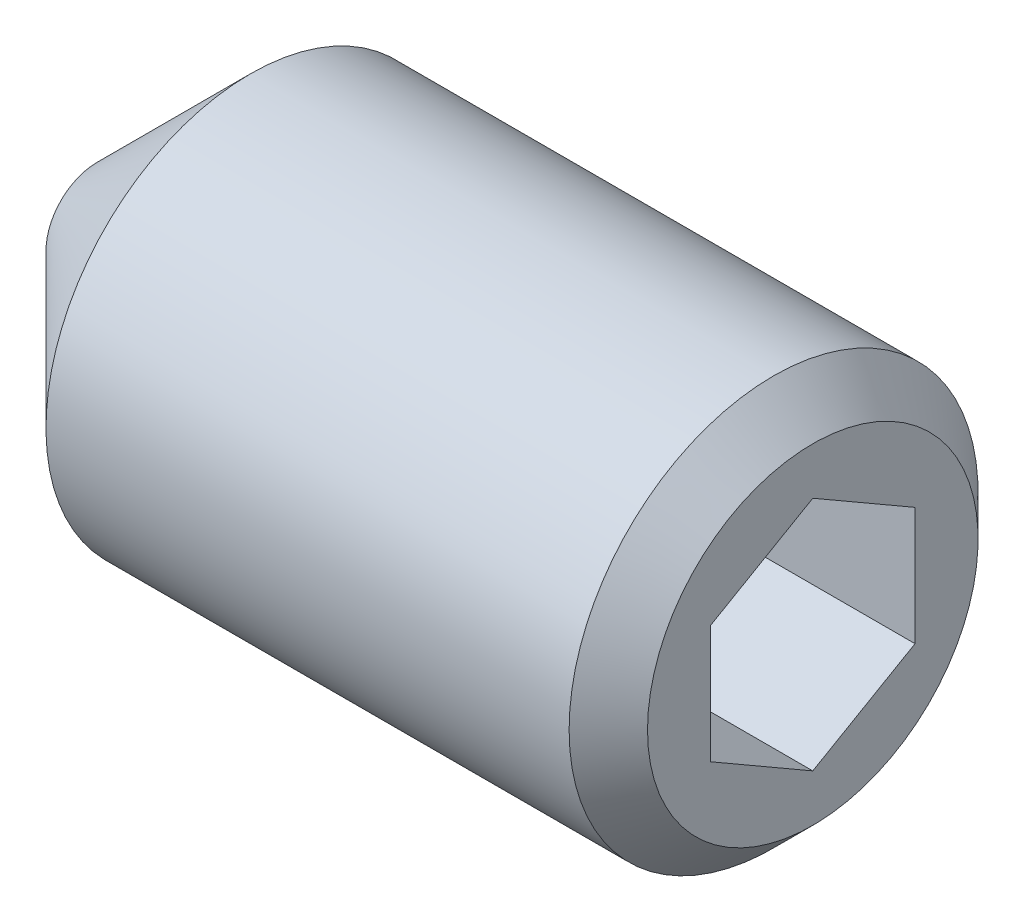
ISO-10303-21;
HEADER;
FILE_DESCRIPTION(('STEP AP214'),'2;1');
FILE_NAME('part.step','',(''),(''),'','','');
FILE_SCHEMA(('AUTOMOTIVE_DESIGN { 1 0 10303 214 1 1 1 1 }'));
ENDSEC;
DATA;
#1=APPLICATION_CONTEXT('core data for automotive mechanical design processes');
#2=APPLICATION_PROTOCOL_DEFINITION('international standard','automotive_design',2000,#1);
#3=PRODUCT_CONTEXT('',#1,'mechanical');
#4=PRODUCT('Part','Part','',(#3));
#5=PRODUCT_RELATED_PRODUCT_CATEGORY('part','',(#4));
#6=PRODUCT_DEFINITION_FORMATION('','',#4);
#7=PRODUCT_DEFINITION_CONTEXT('part definition',#1,'design');
#8=PRODUCT_DEFINITION('design','',#6,#7);
#9=PRODUCT_DEFINITION_SHAPE('','',#8);
#10=(LENGTH_UNIT() NAMED_UNIT(*) SI_UNIT(.MILLI.,.METRE.));
#11=(NAMED_UNIT(*) PLANE_ANGLE_UNIT() SI_UNIT($,.RADIAN.));
#12=(NAMED_UNIT(*) SI_UNIT($,.STERADIAN.) SOLID_ANGLE_UNIT());
#13=UNCERTAINTY_MEASURE_WITH_UNIT(LENGTH_MEASURE(1.E-05),#10,'distance_accuracy_value','');
#14=(GEOMETRIC_REPRESENTATION_CONTEXT(3) GLOBAL_UNCERTAINTY_ASSIGNED_CONTEXT((#13)) GLOBAL_UNIT_ASSIGNED_CONTEXT((#10,
#11,#12)) REPRESENTATION_CONTEXT('',''));
#15=CARTESIAN_POINT('',(0.,0.,0.));
#16=DIRECTION('',(0.,0.,1.));
#17=DIRECTION('',(1.,0.,0.));
#18=AXIS2_PLACEMENT_3D('',#15,#16,#17);
#19=CARTESIAN_POINT('',(9.00800000118807,0.,0.));
#20=DIRECTION('',(1.,0.,0.));
#21=DIRECTION('',(0.,0.,-1.));
#22=AXIS2_PLACEMENT_3D('',#19,#20,#21);
#23=CONICAL_SURFACE('',#22,2.32325748214635,1.04719754985041);
#24=CARTESIAN_POINT('',(7.66666666464744,-1.70530256582424E-10,0.));
#25=VERTEX_POINT('',#24);
#26=VERTEX_LOOP('',#25);
#27=FACE_BOUND('',#26,.T.);
#28=CARTESIAN_POINT('',(9.00000000144632,-1.1547005388733,1.99999999980313));
#29=CARTESIAN_POINT('',(8.97069554661901,-1.20544263425079,1.9121121121046));
#30=CARTESIAN_POINT('',(8.94404467857055,-1.25662273477581,1.82346557748557));
#31=CARTESIAN_POINT('',(8.89752638878152,-1.35986908512504,1.64463765285765));
#32=CARTESIAN_POINT('',(8.87767542165244,-1.41193716884017,1.55445308645704));
#33=CARTESIAN_POINT('',(8.84677596017859,-1.51542808258427,1.37520156576378));
#34=CARTESIAN_POINT('',(8.83552178881234,-1.56683499367059,1.28616218389005));
#35=CARTESIAN_POINT('',(8.82208916933915,-1.66989057615404,1.10766467901636));
#36=CARTESIAN_POINT('',(8.81989959519307,-1.72153887322915,1.01820720436114));
#37=CARTESIAN_POINT('',(8.82446629142046,-1.81803817556745,0.851065509818308));
#38=CARTESIAN_POINT('',(8.83010128650724,-1.86290366133762,0.773356208957408));
#39=CARTESIAN_POINT('',(8.8479573020661,-1.95234234887182,0.61844385798539));
#40=CARTESIAN_POINT('',(8.86018441614834,-1.99691524152218,0.541241343274824));
#41=CARTESIAN_POINT('',(8.89074983478849,-2.0865381811873,0.386009858251314));
#42=CARTESIAN_POINT('',(8.90921764370782,-2.13157689093158,0.308000524666825));
#43=CARTESIAN_POINT('',(8.95113176241171,-2.22098275234762,0.153145030199717));
#44=CARTESIAN_POINT('',(8.97456823036794,-2.26535104852824,0.0762968869695697));
#45=CARTESIAN_POINT('',(9.00000000166053,-2.3094010765472,3.65972336919312E-10));
#46=B_SPLINE_CURVE_WITH_KNOTS('',3,(#28,#29,#30,#31,#32,#33,#34,#35,#36,#37,#38,#39,#40,#41,#42,
#43,#44,#45),.UNSPECIFIED.,.F.,.F.,(4,2,2,2,2,2,2,2,4),(0.,0.317016011630611,0.634793817186324,
0.944707606358906,1.25424088914511,1.52370778262934,1.79342419354458,2.06912162200915,
2.34427797280119),.UNSPECIFIED.);
#47=CARTESIAN_POINT('',(9.00000000164541,-1.15470053826051,1.99999999979432));
#48=VERTEX_POINT('',#47);
#49=CARTESIAN_POINT('',(9.00000000171396,-2.30940107663975,2.05669987642726E-10));
#50=VERTEX_POINT('',#49);
#51=EDGE_CURVE('E22',#48,#50,#46,.T.);
#52=ORIENTED_EDGE('',*,*,#51,.T.);
#53=CARTESIAN_POINT('',(9.00000000144633,-2.30940107683503,-5.26293975634497E-10));
#54=CARTESIAN_POINT('',(8.97069554661902,-2.25865898109189,-0.0878878880137153));
#55=CARTESIAN_POINT('',(8.94404467857055,-2.20747888041687,-0.176534422546136));
#56=CARTESIAN_POINT('',(8.89752638878152,-2.10423252995766,-0.355362347110558));
#57=CARTESIAN_POINT('',(8.87767542165244,-2.05216444628301,-0.445546913534539));
#58=CARTESIAN_POINT('',(8.84677596017859,-1.9486735325677,-0.624798434244422));
#59=CARTESIAN_POINT('',(8.83552178881234,-1.89726662147095,-0.713837816112135));
#60=CARTESIAN_POINT('',(8.82208916933915,-1.79421103897993,-0.892335320981448));
#61=CARTESIAN_POINT('',(8.81989959519307,-1.74256274190766,-0.981792795638309));
#62=CARTESIAN_POINT('',(8.82446629142046,-1.64606343957113,-1.14893449018216));
#63=CARTESIAN_POINT('',(8.83010128650723,-1.60119795380035,-1.22664379104272));
#64=CARTESIAN_POINT('',(8.8479573020661,-1.51175926626571,-1.38155614201448));
#65=CARTESIAN_POINT('',(8.86018441614834,-1.4671863736155,-1.45875865672513));
#66=CARTESIAN_POINT('',(8.89074983478849,-1.37756343395052,-1.61399014174872));
#67=CARTESIAN_POINT('',(8.90921764370782,-1.3325247242062,-1.69199947533319));
#68=CARTESIAN_POINT('',(8.95113176241171,-1.2431188627901,-1.84685496980026));
#69=CARTESIAN_POINT('',(8.97456823036794,-1.19875056660944,-1.92370311303039));
#70=CARTESIAN_POINT('',(9.00000000166053,-1.15470053859054,-1.99999999963402));
#71=B_SPLINE_CURVE_WITH_KNOTS('',3,(#53,#54,#55,#56,#57,#58,#59,#60,#61,#62,#63,#64,#65,#66,#67,
#68,#69,#70),.UNSPECIFIED.,.F.,.F.,(4,2,2,2,2,2,2,2,4),(0.,0.317016011630612,0.634793817186325,
0.944707606358909,1.25424088914511,1.52370778262934,1.79342419354459,2.06912162200916,
2.34427797280119),.UNSPECIFIED.);
#72=CARTESIAN_POINT('',(9.00000000171396,-1.15470053849799,-1.99999999979432));
#73=VERTEX_POINT('',#72);
#74=EDGE_CURVE('E112',#50,#73,#71,.T.);
#75=ORIENTED_EDGE('',*,*,#74,.T.);
#76=CARTESIAN_POINT('',(9.00000000144632,-1.15470053796173,-2.00000000032942));
#77=CARTESIAN_POINT('',(8.97069554661902,-1.05321634684111,-2.00000000011831));
#78=CARTESIAN_POINT('',(8.94404467857055,-0.950856145641067,-2.00000000003171));
#79=CARTESIAN_POINT('',(8.89752638878152,-0.744363444832626,-1.99999999996821));
#80=CARTESIAN_POINT('',(8.87767542165244,-0.640227277442849,-1.99999999999158));
#81=CARTESIAN_POINT('',(8.84677596017859,-0.433245449983443,-2.0000000000082));
#82=CARTESIAN_POINT('',(8.83552178881234,-0.330431627800365,-2.00000000000219));
#83=CARTESIAN_POINT('',(8.82208916933915,-0.124320462825891,-1.99999999999781));
#84=CARTESIAN_POINT('',(8.81989959519307,-0.0210238686785109,-1.99999999999945));
#85=CARTESIAN_POINT('',(8.82446629142046,0.171974735996308,-2.00000000000047));
#86=CARTESIAN_POINT('',(8.83010128650723,0.261705707537264,-2.00000000000013));
#87=CARTESIAN_POINT('',(8.8479573020661,0.440583082606101,-1.99999999999987));
#88=CARTESIAN_POINT('',(8.86018441614834,0.529728867906677,-1.99999999999996));
#89=CARTESIAN_POINT('',(8.89074983478849,0.708974747236779,-2.00000000000004));
#90=CARTESIAN_POINT('',(8.90921764370782,0.799052166725384,-2.00000000000002));
#91=CARTESIAN_POINT('',(8.95113176241171,0.977863889557518,-1.99999999999998));
#92=CARTESIAN_POINT('',(8.97456823036794,1.0666004819188,-1.99999999999996));
#93=CARTESIAN_POINT('',(9.00000000166053,1.15470053795666,-2.));
#94=B_SPLINE_CURVE_WITH_KNOTS('',3,(#76,#77,#78,#79,#80,#81,#82,#83,#84,#85,#86,#87,#88,#89,#90,
#91,#92,#93),.UNSPECIFIED.,.F.,.F.,(4,2,2,2,2,2,2,2,4),(0.,0.317016011630611,0.634793817186325,
0.944707606358907,1.25424088914511,1.52370778262934,1.79342419354459,2.06912162200916,
2.34427797280119),.UNSPECIFIED.);
#95=CARTESIAN_POINT('',(9.00000000171396,1.15470053814176,-1.99999999999999));
#96=VERTEX_POINT('',#95);
#97=EDGE_CURVE('E108',#73,#96,#94,.T.);
#98=ORIENTED_EDGE('',*,*,#97,.T.);
#99=CARTESIAN_POINT('',(9.00000000144632,1.1547005388733,-1.99999999980313));
#100=CARTESIAN_POINT('',(8.97069554661901,1.20544263425078,-1.91211211210459));
#101=CARTESIAN_POINT('',(8.94404467857055,1.2566227347758,-1.82346557748557));
#102=CARTESIAN_POINT('',(8.89752638878151,1.35986908512503,-1.64463765285765));
#103=CARTESIAN_POINT('',(8.87767542165244,1.41193716884016,-1.55445308645704));
#104=CARTESIAN_POINT('',(8.84677596017859,1.51542808258426,-1.37520156576378));
#105=CARTESIAN_POINT('',(8.83552178881233,1.56683499367058,-1.28616218389005));
#106=CARTESIAN_POINT('',(8.82208916933915,1.66989057615403,-1.10766467901636));
#107=CARTESIAN_POINT('',(8.81989959519306,1.72153887322914,-1.01820720436114));
#108=CARTESIAN_POINT('',(8.82446629142046,1.81803817556744,-0.85106550981831));
#109=CARTESIAN_POINT('',(8.83010128650723,1.86290366133761,-0.773356208957409));
#110=CARTESIAN_POINT('',(8.8479573020661,1.95234234887181,-0.61844385798539));
#111=CARTESIAN_POINT('',(8.86018441614834,1.99691524152217,-0.541241343274824));
#112=CARTESIAN_POINT('',(8.89074983478849,2.08653818118729,-0.386009858251314));
#113=CARTESIAN_POINT('',(8.90921764370782,2.13157689093158,-0.308000524666825));
#114=CARTESIAN_POINT('',(8.95113176241171,2.22098275234761,-0.153145030199716));
#115=CARTESIAN_POINT('',(8.97456823036794,2.26535104852824,-0.0762968869695689));
#116=CARTESIAN_POINT('',(9.00000000166053,2.3094010765472,-3.65971082070167E-10));
#117=B_SPLINE_CURVE_WITH_KNOTS('',3,(#99,#100,#101,#102,#103,#104,#105,#106,#107,#108,#109,#110,
#111,#112,#113,#114,#115,#116),.UNSPECIFIED.,.F.,.F.,(4,2,2,2,2,2,2,2,4),(0.,0.31701601163061,
0.634793817186322,0.944707606358904,1.2542408891451,1.52370778262934,1.79342419354458,
2.06912162200915,2.34427797280119),.UNSPECIFIED.);
#118=CARTESIAN_POINT('',(9.00000000171396,2.30940107663975,-2.05673827678857E-10));
#119=VERTEX_POINT('',#118);
#120=EDGE_CURVE('E104',#96,#119,#117,.T.);
#121=ORIENTED_EDGE('',*,*,#120,.T.);
#122=CARTESIAN_POINT('',(9.00000000144632,2.30940107683503,5.26291496868138E-10));
#123=CARTESIAN_POINT('',(8.97069554661901,2.25865898109189,0.0878878880137124));
#124=CARTESIAN_POINT('',(8.94404467857055,2.20747888041687,0.176534422546133));
#125=CARTESIAN_POINT('',(8.89752638878151,2.10423252995766,0.355362347110554));
#126=CARTESIAN_POINT('',(8.87767542165244,2.05216444628301,0.445546913534534));
#127=CARTESIAN_POINT('',(8.84677596017859,1.9486735325677,0.624798434244417));
#128=CARTESIAN_POINT('',(8.83552178881233,1.89726662147095,0.713837816112129));
#129=CARTESIAN_POINT('',(8.82208916933915,1.79421103897992,0.892335320981442));
#130=CARTESIAN_POINT('',(8.81989959519306,1.74256274190765,0.981792795638302));
#131=CARTESIAN_POINT('',(8.82446629142046,1.64606343957113,1.14893449018216));
#132=CARTESIAN_POINT('',(8.83010128650723,1.60119795380035,1.22664379104271));
#133=CARTESIAN_POINT('',(8.8479573020661,1.51175926626571,1.38155614201447));
#134=CARTESIAN_POINT('',(8.86018441614834,1.4671863736155,1.45875865672513));
#135=CARTESIAN_POINT('',(8.89074983478849,1.37756343395051,1.61399014174872));
#136=CARTESIAN_POINT('',(8.90921764370782,1.33252472420619,1.69199947533319));
#137=CARTESIAN_POINT('',(8.95113176241171,1.24311886279009,1.84685496980026));
#138=CARTESIAN_POINT('',(8.97456823036794,1.19875056660943,1.92370311303039));
#139=CARTESIAN_POINT('',(9.00000000166053,1.15470053859053,1.99999999963403));
#140=B_SPLINE_CURVE_WITH_KNOTS('',3,(#122,#123,#124,#125,#126,#127,#128,#129,#130,#131,#132,
#133,#134,#135,#136,#137,#138,#139),.UNSPECIFIED.,.F.,.F.,(4,2,2,2,2,2,2,2,4),(0.,
0.317016011630611,0.634793817186323,0.944707606358905,1.25424088914511,1.52370778262934,
1.79342419354459,2.06912162200916,2.3442779728012),.UNSPECIFIED.);
#141=CARTESIAN_POINT('',(9.00000000171396,1.15470053849799,1.99999999979432));
#142=VERTEX_POINT('',#141);
#143=EDGE_CURVE('E87',#119,#142,#140,.T.);
#144=ORIENTED_EDGE('',*,*,#143,.T.);
#145=CARTESIAN_POINT('',(9.00000000144632,1.15470053796172,2.00000000032942));
#146=CARTESIAN_POINT('',(8.97069554661901,1.0532163468411,2.00000000011831));
#147=CARTESIAN_POINT('',(8.94404467857055,0.950856145641057,2.00000000003171));
#148=CARTESIAN_POINT('',(8.89752638878151,0.744363444832616,1.99999999996821));
#149=CARTESIAN_POINT('',(8.87767542165244,0.64022727744284,1.99999999999158));
#150=CARTESIAN_POINT('',(8.84677596017859,0.433245449983435,2.0000000000082));
#151=CARTESIAN_POINT('',(8.83552178881233,0.330431627800356,2.00000000000218));
#152=CARTESIAN_POINT('',(8.82208916933915,0.124320462825883,1.99999999999781));
#153=CARTESIAN_POINT('',(8.81989959519307,0.0210238686785036,1.99999999999945));
#154=CARTESIAN_POINT('',(8.82446629142046,-0.171974735996315,2.00000000000047));
#155=CARTESIAN_POINT('',(8.83010128650724,-0.261705707537271,2.00000000000013));
#156=CARTESIAN_POINT('',(8.8479573020661,-0.440583082606108,1.99999999999987));
#157=CARTESIAN_POINT('',(8.86018441614834,-0.529728867906684,1.99999999999996));
#158=CARTESIAN_POINT('',(8.89074983478849,-0.708974747236785,2.00000000000003));
#159=CARTESIAN_POINT('',(8.90921764370782,-0.79905216672539,2.00000000000002));
#160=CARTESIAN_POINT('',(8.95113176241171,-0.977863889557524,1.99999999999998));
#161=CARTESIAN_POINT('',(8.97456823036794,-1.06660048191881,1.99999999999996));
#162=CARTESIAN_POINT('',(9.00000000166053,-1.15470053795667,2.));
#163=B_SPLINE_CURVE_WITH_KNOTS('',3,(#145,#146,#147,#148,#149,#150,#151,#152,#153,#154,#155,
#156,#157,#158,#159,#160,#161,#162),.UNSPECIFIED.,.F.,.F.,(4,2,2,2,2,2,2,2,4),(0.,
0.31701601163061,0.634793817186323,0.944707606358904,1.2542408891451,1.52370778262934,
1.79342419354458,2.06912162200915,2.34427797280119),.UNSPECIFIED.);
#164=EDGE_CURVE('E85',#142,#48,#163,.T.);
#165=ORIENTED_EDGE('',*,*,#164,.T.);
#166=EDGE_LOOP('',(#52,#75,#98,#121,#144,#165));
#167=FACE_BOUND('',#166,.T.);
#168=ADVANCED_FACE('F18',(#27,#167),#23,.F.);
#169=CARTESIAN_POINT('',(14.,-1.15470053837926,1.99999999999999));
#170=DIRECTION('',(0.,-0.86602540378444,0.499999999999998));
#171=DIRECTION('',(0.,-0.499999999999998,-0.86602540378444));
#172=AXIS2_PLACEMENT_3D('',#169,#170,#171);
#173=PLANE('',#172);
#174=DIRECTION('',(1.,0.,0.));
#175=VECTOR('',#174,1.);
#176=CARTESIAN_POINT('',(14.,-1.15470053837926,2.));
#177=LINE('',#176,#175);
#178=CARTESIAN_POINT('',(14.,-1.15470053837926,2.));
#179=VERTEX_POINT('',#178);
#180=EDGE_CURVE('E78',#48,#179,#177,.T.);
#181=ORIENTED_EDGE('',*,*,#180,.T.);
#182=DIRECTION('',(0.,-0.499999999999997,-0.86602540378444));
#183=VECTOR('',#182,1.);
#184=CARTESIAN_POINT('',(14.,-1.15470053837926,1.99999999999999));
#185=LINE('',#184,#183);
#186=CARTESIAN_POINT('',(14.,-2.3094010767585,0.));
#187=VERTEX_POINT('',#186);
#188=EDGE_CURVE('E89',#179,#187,#185,.T.);
#189=ORIENTED_EDGE('',*,*,#188,.T.);
#190=DIRECTION('',(1.,0.,0.));
#191=VECTOR('',#190,1.);
#192=CARTESIAN_POINT('',(14.,-2.3094010767585,0.));
#193=LINE('',#192,#191);
#194=EDGE_CURVE('E81',#187,#50,#193,.F.);
#195=ORIENTED_EDGE('',*,*,#194,.T.);
#196=ORIENTED_EDGE('',*,*,#51,.F.);
#197=EDGE_LOOP('',(#181,#189,#195,#196));
#198=FACE_BOUND('',#197,.T.);
#199=ADVANCED_FACE('F76',(#198),#173,.F.);
#200=CARTESIAN_POINT('',(14.,-2.3094010767585,0.));
#201=DIRECTION('',(0.,-0.866025403784437,-0.500000000000003));
#202=DIRECTION('',(0.,0.500000000000003,-0.866025403784437));
#203=AXIS2_PLACEMENT_3D('',#200,#201,#202);
#204=PLANE('',#203);
#205=ORIENTED_EDGE('',*,*,#194,.F.);
#206=DIRECTION('',(0.,0.500000000000003,-0.866025403784437));
#207=VECTOR('',#206,1.);
#208=CARTESIAN_POINT('',(14.,-2.3094010767585,0.));
#209=LINE('',#208,#207);
#210=CARTESIAN_POINT('',(14.,-1.15470053837925,-2.));
#211=VERTEX_POINT('',#210);
#212=EDGE_CURVE('E119',#187,#211,#209,.T.);
#213=ORIENTED_EDGE('',*,*,#212,.T.);
#214=DIRECTION('',(-1.,0.,0.));
#215=VECTOR('',#214,1.);
#216=CARTESIAN_POINT('',(14.,-1.15470053837925,-2.));
#217=LINE('',#216,#215);
#218=EDGE_CURVE('E109',#211,#73,#217,.T.);
#219=ORIENTED_EDGE('',*,*,#218,.T.);
#220=ORIENTED_EDGE('',*,*,#74,.F.);
#221=EDGE_LOOP('',(#205,#213,#219,#220));
#222=FACE_BOUND('',#221,.T.);
#223=ADVANCED_FACE('F164',(#222),#204,.F.);
#224=CARTESIAN_POINT('',(14.,-1.15470053837925,-2.));
#225=DIRECTION('',(0.,0.,-1.));
#226=DIRECTION('',(-1.,0.,0.));
#227=AXIS2_PLACEMENT_3D('',#224,#225,#226);
#228=PLANE('',#227);
#229=ORIENTED_EDGE('',*,*,#218,.F.);
#230=DIRECTION('',(0.,1.,0.));
#231=VECTOR('',#230,1.);
#232=CARTESIAN_POINT('',(14.,0.,-2.));
#233=LINE('',#232,#231);
#234=CARTESIAN_POINT('',(14.,1.15470053837925,-1.99999999999999));
#235=VERTEX_POINT('',#234);
#236=EDGE_CURVE('E121',#211,#235,#233,.T.);
#237=ORIENTED_EDGE('',*,*,#236,.T.);
#238=DIRECTION('',(1.,0.,0.));
#239=VECTOR('',#238,1.);
#240=CARTESIAN_POINT('',(14.,1.15470053837925,-1.99999999999999));
#241=LINE('',#240,#239);
#242=EDGE_CURVE('E105',#235,#96,#241,.F.);
#243=ORIENTED_EDGE('',*,*,#242,.T.);
#244=ORIENTED_EDGE('',*,*,#97,.F.);
#245=EDGE_LOOP('',(#229,#237,#243,#244));
#246=FACE_BOUND('',#245,.T.);
#247=ADVANCED_FACE('F150',(#246),#228,.F.);
#248=CARTESIAN_POINT('',(14.,1.15470053837925,-1.99999999999999));
#249=DIRECTION('',(0.,0.86602540378444,-0.499999999999998));
#250=DIRECTION('',(0.,0.499999999999998,0.86602540378444));
#251=AXIS2_PLACEMENT_3D('',#248,#249,#250);
#252=PLANE('',#251);
#253=ORIENTED_EDGE('',*,*,#242,.F.);
#254=DIRECTION('',(0.,0.500000000000001,0.866025403784438));
#255=VECTOR('',#254,1.);
#256=CARTESIAN_POINT('',(14.,1.15470053837925,-1.99999999999999));
#257=LINE('',#256,#255);
#258=CARTESIAN_POINT('',(14.,2.3094010767585,0.));
#259=VERTEX_POINT('',#258);
#260=EDGE_CURVE('E115',#235,#259,#257,.T.);
#261=ORIENTED_EDGE('',*,*,#260,.T.);
#262=DIRECTION('',(1.,0.,0.));
#263=VECTOR('',#262,1.);
#264=CARTESIAN_POINT('',(14.,2.3094010767585,0.));
#265=LINE('',#264,#263);
#266=EDGE_CURVE('E98',#259,#119,#265,.F.);
#267=ORIENTED_EDGE('',*,*,#266,.T.);
#268=ORIENTED_EDGE('',*,*,#120,.F.);
#269=EDGE_LOOP('',(#253,#261,#267,#268));
#270=FACE_BOUND('',#269,.T.);
#271=ADVANCED_FACE('F146',(#270),#252,.F.);
#272=CARTESIAN_POINT('',(14.,2.30940107675849,0.));
#273=DIRECTION('',(0.,0.866025403784437,0.500000000000002));
#274=DIRECTION('',(0.,-0.500000000000002,0.866025403784437));
#275=AXIS2_PLACEMENT_3D('',#272,#273,#274);
#276=PLANE('',#275);
#277=ORIENTED_EDGE('',*,*,#266,.F.);
#278=DIRECTION('',(0.,-0.500000000000003,0.866025403784437));
#279=VECTOR('',#278,1.);
#280=CARTESIAN_POINT('',(14.,2.3094010767585,0.));
#281=LINE('',#280,#279);
#282=CARTESIAN_POINT('',(14.,1.15470053837924,2.));
#283=VERTEX_POINT('',#282);
#284=EDGE_CURVE('E40',#259,#283,#281,.T.);
#285=ORIENTED_EDGE('',*,*,#284,.T.);
#286=DIRECTION('',(1.,0.,0.));
#287=VECTOR('',#286,1.);
#288=CARTESIAN_POINT('',(14.,1.15470053837924,2.));
#289=LINE('',#288,#287);
#290=EDGE_CURVE('E90',#283,#142,#289,.F.);
#291=ORIENTED_EDGE('',*,*,#290,.T.);
#292=ORIENTED_EDGE('',*,*,#143,.F.);
#293=EDGE_LOOP('',(#277,#285,#291,#292));
#294=FACE_BOUND('',#293,.T.);
#295=ADVANCED_FACE('F141',(#294),#276,.F.);
#296=CARTESIAN_POINT('',(14.,1.15470053837924,2.));
#297=DIRECTION('',(0.,0.,1.));
#298=DIRECTION('',(1.,0.,0.));
#299=AXIS2_PLACEMENT_3D('',#296,#297,#298);
#300=PLANE('',#299);
#301=ORIENTED_EDGE('',*,*,#290,.F.);
#302=DIRECTION('',(0.,1.,0.));
#303=VECTOR('',#302,1.);
#304=CARTESIAN_POINT('',(14.,0.,2.));
#305=LINE('',#304,#303);
#306=EDGE_CURVE('E94',#283,#179,#305,.F.);
#307=ORIENTED_EDGE('',*,*,#306,.T.);
#308=ORIENTED_EDGE('',*,*,#180,.F.);
#309=ORIENTED_EDGE('',*,*,#164,.F.);
#310=EDGE_LOOP('',(#301,#307,#308,#309));
#311=FACE_BOUND('',#310,.T.);
#312=ADVANCED_FACE('F92',(#311),#300,.F.);
#313=CARTESIAN_POINT('',(0.,2.,0.));
#314=DIRECTION('',(-1.,0.,0.));
#315=DIRECTION('',(0.,0.,1.));
#316=AXIS2_PLACEMENT_3D('',#313,#314,#315);
#317=PLANE('',#316);
#318=CARTESIAN_POINT('',(-1.36424205265939E-09,0.,0.));
#319=DIRECTION('',(1.,0.,0.));
#320=DIRECTION('',(0.,1.,0.));
#321=AXIS2_PLACEMENT_3D('',#318,#319,#320);
#322=CIRCLE('',#321,1.00000000128375);
#323=CARTESIAN_POINT('',(-1.36424216107961E-09,1.00000000128375,0.));
#324=VERTEX_POINT('',#323);
#325=EDGE_CURVE('E117',#324,#324,#322,.T.);
#326=ORIENTED_EDGE('',*,*,#325,.F.);
#327=EDGE_LOOP('',(#326));
#328=FACE_BOUND('',#327,.T.);
#329=ADVANCED_FACE('F140',(#328),#317,.T.);
#330=CARTESIAN_POINT('',(14.,0.,0.));
#331=DIRECTION('',(-1.,0.,0.));
#332=DIRECTION('',(0.,0.,1.));
#333=AXIS2_PLACEMENT_3D('',#330,#331,#332);
#334=PLANE('',#333);
#335=ORIENTED_EDGE('',*,*,#284,.F.);
#336=ORIENTED_EDGE('',*,*,#260,.F.);
#337=ORIENTED_EDGE('',*,*,#236,.F.);
#338=ORIENTED_EDGE('',*,*,#212,.F.);
#339=ORIENTED_EDGE('',*,*,#188,.F.);
#340=ORIENTED_EDGE('',*,*,#306,.F.);
#341=EDGE_LOOP('',(#335,#336,#337,#338,#339,#340));
#342=FACE_BOUND('',#341,.T.);
#343=CARTESIAN_POINT('',(14.0000000002942,0.,0.));
#344=DIRECTION('',(-1.,0.,0.));
#345=DIRECTION('',(0.,0.,1.));
#346=AXIS2_PLACEMENT_3D('',#343,#344,#345);
#347=CIRCLE('',#346,3.23318750031376);
#348=CARTESIAN_POINT('',(14.0000000002942,0.,3.23318750031376));
#349=VERTEX_POINT('',#348);
#350=EDGE_CURVE('E124',#349,#349,#347,.T.);
#351=ORIENTED_EDGE('',*,*,#350,.F.);
#352=EDGE_LOOP('',(#351));
#353=FACE_BOUND('',#352,.T.);
#354=ADVANCED_FACE('F189',(#342,#353),#334,.F.);
#355=CARTESIAN_POINT('',(3.00000000135014,0.,0.));
#356=DIRECTION('',(1.,0.,0.));
#357=DIRECTION('',(0.,1.,0.));
#358=AXIS2_PLACEMENT_3D('',#355,#356,#357);
#359=CONICAL_SURFACE('',#358,3.99999999865486,0.785398162506902);
#360=CARTESIAN_POINT('',(3.,0.,0.));
#361=DIRECTION('',(1.,0.,0.));
#362=DIRECTION('',(0.,1.,0.));
#363=AXIS2_PLACEMENT_3D('',#360,#361,#362);
#364=CIRCLE('',#363,4.);
#365=CARTESIAN_POINT('',(3.,4.,0.));
#366=VERTEX_POINT('',#365);
#367=EDGE_CURVE('E31',#366,#366,#364,.T.);
#368=ORIENTED_EDGE('',*,*,#367,.F.);
#369=EDGE_LOOP('',(#368));
#370=FACE_BOUND('',#369,.T.);
#371=ORIENTED_EDGE('',*,*,#325,.T.);
#372=EDGE_LOOP('',(#371));
#373=FACE_BOUND('',#372,.T.);
#374=ADVANCED_FACE('F183',(#370,#373),#359,.T.);
#375=CARTESIAN_POINT('',(13.2331874996794,0.,0.));
#376=DIRECTION('',(-1.,0.,0.));
#377=DIRECTION('',(0.,0.,1.));
#378=AXIS2_PLACEMENT_3D('',#375,#376,#377);
#379=CONICAL_SURFACE('',#378,3.9999999996212,0.785398162544959);
#380=ORIENTED_EDGE('',*,*,#350,.T.);
#381=EDGE_LOOP('',(#380));
#382=FACE_BOUND('',#381,.T.);
#383=CARTESIAN_POINT('',(13.2331875,0.,0.));
#384=DIRECTION('',(1.,0.,0.));
#385=DIRECTION('',(0.,1.,0.));
#386=AXIS2_PLACEMENT_3D('',#383,#384,#385);
#387=CIRCLE('',#386,4.);
#388=CARTESIAN_POINT('',(13.2331875,4.,0.));
#389=VERTEX_POINT('',#388);
#390=EDGE_CURVE('E10',#389,#389,#387,.F.);
#391=ORIENTED_EDGE('',*,*,#390,.F.);
#392=EDGE_LOOP('',(#391));
#393=FACE_BOUND('',#392,.T.);
#394=ADVANCED_FACE('F177',(#382,#393),#379,.T.);
#395=CARTESIAN_POINT('',(7.,0.,0.));
#396=DIRECTION('',(1.,0.,0.));
#397=DIRECTION('',(0.,1.,0.));
#398=AXIS2_PLACEMENT_3D('',#395,#396,#397);
#399=CYLINDRICAL_SURFACE('',#398,4.);
#400=ORIENTED_EDGE('',*,*,#390,.T.);
#401=EDGE_LOOP('',(#400));
#402=FACE_BOUND('',#401,.T.);
#403=ORIENTED_EDGE('',*,*,#367,.T.);
#404=EDGE_LOOP('',(#403));
#405=FACE_BOUND('',#404,.T.);
#406=ADVANCED_FACE('F175',(#402,#405),#399,.T.);
#407=CLOSED_SHELL('',(#168,#199,#223,#247,#271,#295,#312,#329,#354,#374,#394,#406));
#408=MANIFOLD_SOLID_BREP('B1',#407);
#409=ADVANCED_BREP_SHAPE_REPRESENTATION('',(#18,#408),#14);
#410=SHAPE_DEFINITION_REPRESENTATION(#9,#409);
ENDSEC;
END-ISO-10303-21;
